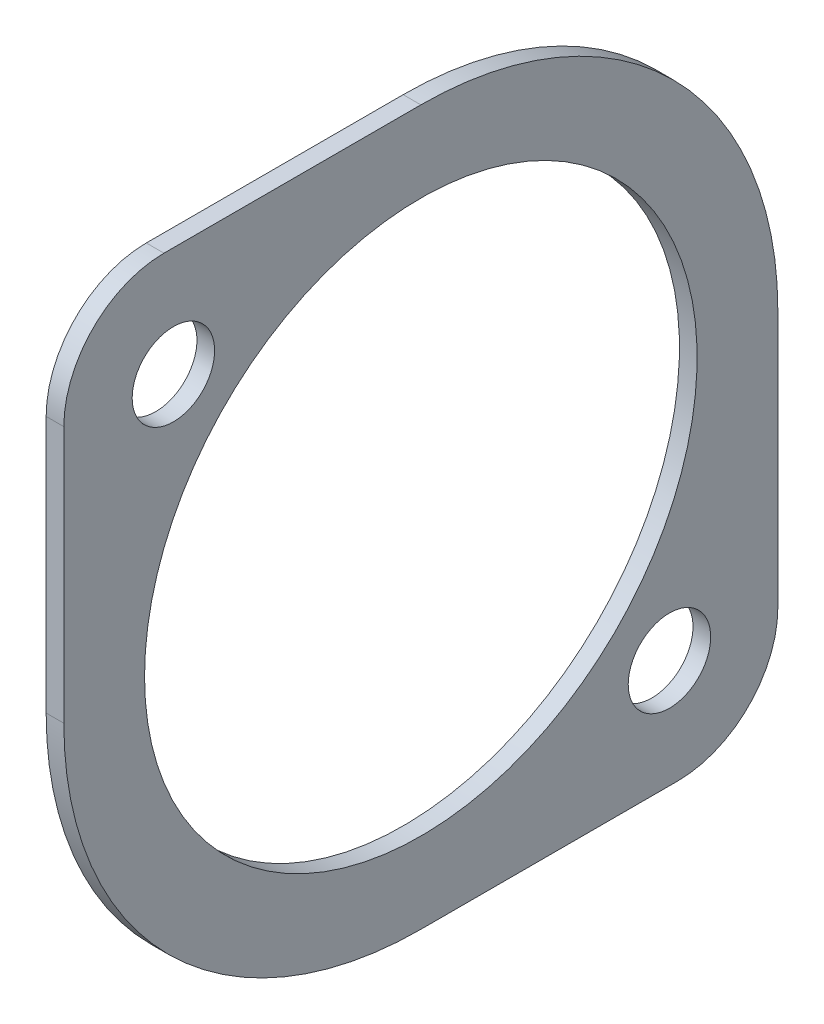
ISO-10303-21;
HEADER;
FILE_DESCRIPTION(('STEP AP214'),'2;1');
FILE_NAME('part.step','',(''),(''),'','','');
FILE_SCHEMA(('AUTOMOTIVE_DESIGN { 1 0 10303 214 1 1 1 1 }'));
ENDSEC;
DATA;
#1=APPLICATION_CONTEXT('core data for automotive mechanical design processes');
#2=APPLICATION_PROTOCOL_DEFINITION('international standard','automotive_design',2000,#1);
#3=PRODUCT_CONTEXT('',#1,'mechanical');
#4=PRODUCT('Part','Part','',(#3));
#5=PRODUCT_RELATED_PRODUCT_CATEGORY('part','',(#4));
#6=PRODUCT_DEFINITION_FORMATION('','',#4);
#7=PRODUCT_DEFINITION_CONTEXT('part definition',#1,'design');
#8=PRODUCT_DEFINITION('design','',#6,#7);
#9=PRODUCT_DEFINITION_SHAPE('','',#8);
#10=(LENGTH_UNIT() NAMED_UNIT(*) SI_UNIT(.MILLI.,.METRE.));
#11=(NAMED_UNIT(*) PLANE_ANGLE_UNIT() SI_UNIT($,.RADIAN.));
#12=(NAMED_UNIT(*) SI_UNIT($,.STERADIAN.) SOLID_ANGLE_UNIT());
#13=UNCERTAINTY_MEASURE_WITH_UNIT(LENGTH_MEASURE(1.E-05),#10,'distance_accuracy_value','');
#14=(GEOMETRIC_REPRESENTATION_CONTEXT(3) GLOBAL_UNCERTAINTY_ASSIGNED_CONTEXT((#13)) GLOBAL_UNIT_ASSIGNED_CONTEXT((#10,
#11,#12)) REPRESENTATION_CONTEXT('',''));
#15=CARTESIAN_POINT('',(0.,0.,0.));
#16=DIRECTION('',(0.,0.,1.));
#17=DIRECTION('',(1.,0.,0.));
#18=AXIS2_PLACEMENT_3D('',#15,#16,#17);
#19=CARTESIAN_POINT('',(1.11633201222204,15.875,-15.875));
#20=DIRECTION('',(1.,0.,0.));
#21=DIRECTION('',(0.,0.,-1.));
#22=AXIS2_PLACEMENT_3D('',#19,#20,#21);
#23=PLANE('',#22);
#24=CARTESIAN_POINT('',(1.11633201222204,21.209,-10.541));
#25=DIRECTION('',(-1.,0.,0.));
#26=DIRECTION('',(0.,0.,1.));
#27=AXIS2_PLACEMENT_3D('',#24,#25,#26);
#28=CIRCLE('',#27,0.889);
#29=CARTESIAN_POINT('',(1.11633201222204,21.209,-9.652));
#30=VERTEX_POINT('',#29);
#31=EDGE_CURVE('E133',#30,#30,#28,.F.);
#32=ORIENTED_EDGE('',*,*,#31,.T.);
#33=EDGE_LOOP('',(#32));
#34=FACE_BOUND('',#33,.T.);
#35=CARTESIAN_POINT('',(1.11633201222204,10.5156,-21.2344));
#36=DIRECTION('',(-1.,0.,0.));
#37=DIRECTION('',(0.,0.,1.));
#38=AXIS2_PLACEMENT_3D('',#35,#36,#37);
#39=CIRCLE('',#38,0.889);
#40=CARTESIAN_POINT('',(1.11633201222204,10.5156,-20.3454));
#41=VERTEX_POINT('',#40);
#42=EDGE_CURVE('E136',#41,#41,#39,.F.);
#43=ORIENTED_EDGE('',*,*,#42,.T.);
#44=EDGE_LOOP('',(#43));
#45=FACE_BOUND('',#44,.T.);
#46=CARTESIAN_POINT('',(1.11633201222204,15.875,-15.875));
#47=DIRECTION('',(-1.,0.,0.));
#48=DIRECTION('',(0.,0.,1.));
#49=AXIS2_PLACEMENT_3D('',#46,#47,#48);
#50=CIRCLE('',#49,5.9563);
#51=CARTESIAN_POINT('',(1.11633201222204,15.875,-9.9187));
#52=VERTEX_POINT('',#51);
#53=EDGE_CURVE('E99',#52,#52,#50,.F.);
#54=ORIENTED_EDGE('',*,*,#53,.T.);
#55=EDGE_LOOP('',(#54));
#56=FACE_BOUND('',#55,.T.);
#57=DIRECTION('',(0.,1.,0.));
#58=VECTOR('',#57,1.);
#59=CARTESIAN_POINT('',(1.11633201222204,18.6436,-8.1788));
#60=LINE('',#59,#58);
#61=CARTESIAN_POINT('',(1.11633201222204,21.4122,-8.1788));
#62=VERTEX_POINT('',#61);
#63=CARTESIAN_POINT('',(1.11633201222204,15.875,-8.1788));
#64=VERTEX_POINT('',#63);
#65=EDGE_CURVE('E105',#62,#64,#60,.F.);
#66=ORIENTED_EDGE('',*,*,#65,.F.);
#67=CARTESIAN_POINT('',(1.11633201222204,21.4122,-10.3378));
#68=DIRECTION('',(-1.,0.,0.));
#69=DIRECTION('',(0.,0.,1.));
#70=AXIS2_PLACEMENT_3D('',#67,#68,#69);
#71=CIRCLE('',#70,2.159);
#72=CARTESIAN_POINT('',(1.11633201222204,23.5712,-10.3378));
#73=VERTEX_POINT('',#72);
#74=EDGE_CURVE('E142',#73,#62,#71,.F.);
#75=ORIENTED_EDGE('',*,*,#74,.F.);
#76=DIRECTION('',(0.,0.,1.));
#77=VECTOR('',#76,1.);
#78=CARTESIAN_POINT('',(1.11633201222204,23.5712,-13.1064));
#79=LINE('',#78,#77);
#80=CARTESIAN_POINT('',(1.11633201222204,23.5712,-15.875));
#81=VERTEX_POINT('',#80);
#82=EDGE_CURVE('E109',#81,#73,#79,.T.);
#83=ORIENTED_EDGE('',*,*,#82,.F.);
#84=CARTESIAN_POINT('',(1.11633201222204,15.875,-15.875));
#85=DIRECTION('',(-1.,0.,0.));
#86=DIRECTION('',(0.,0.,1.));
#87=AXIS2_PLACEMENT_3D('',#84,#85,#86);
#88=CIRCLE('',#87,7.6962);
#89=CARTESIAN_POINT('',(1.11633201222204,15.875,-23.5712));
#90=VERTEX_POINT('',#89);
#91=EDGE_CURVE('E143',#90,#81,#88,.F.);
#92=ORIENTED_EDGE('',*,*,#91,.F.);
#93=DIRECTION('',(0.,1.,0.));
#94=VECTOR('',#93,1.);
#95=CARTESIAN_POINT('',(1.11633201222204,13.1064,-23.5712));
#96=LINE('',#95,#94);
#97=CARTESIAN_POINT('',(1.11633201222204,10.3378,-23.5712));
#98=VERTEX_POINT('',#97);
#99=EDGE_CURVE('E85',#90,#98,#96,.F.);
#100=ORIENTED_EDGE('',*,*,#99,.T.);
#101=CARTESIAN_POINT('',(1.11633201222204,10.3378,-21.4122));
#102=DIRECTION('',(-1.,0.,0.));
#103=DIRECTION('',(0.,0.,1.));
#104=AXIS2_PLACEMENT_3D('',#101,#102,#103);
#105=CIRCLE('',#104,2.159);
#106=CARTESIAN_POINT('',(1.11633201222204,8.1788,-21.4122));
#107=VERTEX_POINT('',#106);
#108=EDGE_CURVE('E19',#107,#98,#105,.F.);
#109=ORIENTED_EDGE('',*,*,#108,.F.);
#110=DIRECTION('',(0.,0.,1.));
#111=VECTOR('',#110,1.);
#112=CARTESIAN_POINT('',(1.11633201222204,8.1788,-18.6436));
#113=LINE('',#112,#111);
#114=CARTESIAN_POINT('',(1.11633201222204,8.1788,-15.875));
#115=VERTEX_POINT('',#114);
#116=EDGE_CURVE('E83',#107,#115,#113,.T.);
#117=ORIENTED_EDGE('',*,*,#116,.T.);
#118=CARTESIAN_POINT('',(1.11633201222204,15.875,-15.875));
#119=DIRECTION('',(-1.,0.,0.));
#120=DIRECTION('',(0.,0.,1.));
#121=AXIS2_PLACEMENT_3D('',#118,#119,#120);
#122=CIRCLE('',#121,7.6962);
#123=EDGE_CURVE('E95',#64,#115,#122,.F.);
#124=ORIENTED_EDGE('',*,*,#123,.F.);
#125=EDGE_LOOP('',(#66,#75,#83,#92,#100,#109,#117,#124));
#126=FACE_BOUND('',#125,.T.);
#127=ADVANCED_FACE('F16',(#34,#45,#56,#126),#23,.F.);
#128=CARTESIAN_POINT('',(1.52345778202475,10.3378,-21.4122));
#129=DIRECTION('',(-1.,0.,0.));
#130=DIRECTION('',(0.,0.,1.));
#131=AXIS2_PLACEMENT_3D('',#128,#129,#130);
#132=CYLINDRICAL_SURFACE('',#131,2.159);
#133=DIRECTION('',(1.,0.,0.));
#134=VECTOR('',#133,1.);
#135=CARTESIAN_POINT('',(1.30683201222204,10.3378,-23.5712));
#136=LINE('',#135,#134);
#137=CARTESIAN_POINT('',(1.49733201222204,10.3378,-23.5712));
#138=VERTEX_POINT('',#137);
#139=EDGE_CURVE('E103',#98,#138,#136,.T.);
#140=ORIENTED_EDGE('',*,*,#139,.T.);
#141=CARTESIAN_POINT('',(1.49733201222204,10.3378,-21.4122));
#142=DIRECTION('',(-1.,0.,0.));
#143=DIRECTION('',(0.,0.,1.));
#144=AXIS2_PLACEMENT_3D('',#141,#142,#143);
#145=CIRCLE('',#144,2.159);
#146=CARTESIAN_POINT('',(1.49733201222204,8.1788,-21.4122));
#147=VERTEX_POINT('',#146);
#148=EDGE_CURVE('E92',#147,#138,#145,.F.);
#149=ORIENTED_EDGE('',*,*,#148,.F.);
#150=DIRECTION('',(1.,0.,0.));
#151=VECTOR('',#150,1.);
#152=CARTESIAN_POINT('',(1.30683201222204,8.1788,-21.4122));
#153=LINE('',#152,#151);
#154=EDGE_CURVE('E89',#147,#107,#153,.F.);
#155=ORIENTED_EDGE('',*,*,#154,.T.);
#156=ORIENTED_EDGE('',*,*,#108,.T.);
#157=EDGE_LOOP('',(#140,#149,#155,#156));
#158=FACE_BOUND('',#157,.T.);
#159=ADVANCED_FACE('F90',(#158),#132,.T.);
#160=CARTESIAN_POINT('',(1.30683201222204,13.1064,-23.5712));
#161=DIRECTION('',(0.,0.,1.));
#162=DIRECTION('',(1.,0.,0.));
#163=AXIS2_PLACEMENT_3D('',#160,#161,#162);
#164=PLANE('',#163);
#165=ORIENTED_EDGE('',*,*,#99,.F.);
#166=DIRECTION('',(-1.,0.,0.));
#167=VECTOR('',#166,1.);
#168=CARTESIAN_POINT('',(1.52345778202475,15.875,-23.5712));
#169=LINE('',#168,#167);
#170=CARTESIAN_POINT('',(1.49733201222204,15.875,-23.5712));
#171=VERTEX_POINT('',#170);
#172=EDGE_CURVE('E144',#171,#90,#169,.T.);
#173=ORIENTED_EDGE('',*,*,#172,.F.);
#174=DIRECTION('',(0.,1.,0.));
#175=VECTOR('',#174,1.);
#176=CARTESIAN_POINT('',(1.49733201222204,15.875,-23.5712));
#177=LINE('',#176,#175);
#178=EDGE_CURVE('E131',#138,#171,#177,.T.);
#179=ORIENTED_EDGE('',*,*,#178,.F.);
#180=ORIENTED_EDGE('',*,*,#139,.F.);
#181=EDGE_LOOP('',(#165,#173,#179,#180));
#182=FACE_BOUND('',#181,.T.);
#183=ADVANCED_FACE('F180',(#182),#164,.F.);
#184=CARTESIAN_POINT('',(1.52345778202475,15.875,-15.875));
#185=DIRECTION('',(-1.,0.,0.));
#186=DIRECTION('',(0.,0.,1.));
#187=AXIS2_PLACEMENT_3D('',#184,#185,#186);
#188=CYLINDRICAL_SURFACE('',#187,7.6962);
#189=DIRECTION('',(1.,0.,0.));
#190=VECTOR('',#189,1.);
#191=CARTESIAN_POINT('',(1.30683201222204,23.5712,-15.875));
#192=LINE('',#191,#190);
#193=CARTESIAN_POINT('',(1.49733201222204,23.5712,-15.875));
#194=VERTEX_POINT('',#193);
#195=EDGE_CURVE('E112',#194,#81,#192,.F.);
#196=ORIENTED_EDGE('',*,*,#195,.F.);
#197=CARTESIAN_POINT('',(1.49733201222204,15.875,-15.875));
#198=DIRECTION('',(-1.,0.,0.));
#199=DIRECTION('',(0.,0.,1.));
#200=AXIS2_PLACEMENT_3D('',#197,#198,#199);
#201=CIRCLE('',#200,7.6962);
#202=EDGE_CURVE('E128',#171,#194,#201,.F.);
#203=ORIENTED_EDGE('',*,*,#202,.F.);
#204=ORIENTED_EDGE('',*,*,#172,.T.);
#205=ORIENTED_EDGE('',*,*,#91,.T.);
#206=EDGE_LOOP('',(#196,#203,#204,#205));
#207=FACE_BOUND('',#206,.T.);
#208=ADVANCED_FACE('F177',(#207),#188,.T.);
#209=CARTESIAN_POINT('',(1.30683201222204,23.5712,-13.1064));
#210=DIRECTION('',(0.,1.,0.));
#211=DIRECTION('',(0.,0.,1.));
#212=AXIS2_PLACEMENT_3D('',#209,#210,#211);
#213=PLANE('',#212);
#214=DIRECTION('',(-1.,0.,0.));
#215=VECTOR('',#214,1.);
#216=CARTESIAN_POINT('',(1.52345778202475,23.5712,-10.3378));
#217=LINE('',#216,#215);
#218=CARTESIAN_POINT('',(1.49733201222204,23.5712,-10.3378));
#219=VERTEX_POINT('',#218);
#220=EDGE_CURVE('E111',#219,#73,#217,.T.);
#221=ORIENTED_EDGE('',*,*,#220,.F.);
#222=DIRECTION('',(0.,0.,-1.));
#223=VECTOR('',#222,1.);
#224=CARTESIAN_POINT('',(1.49733201222204,23.5712,-15.875));
#225=LINE('',#224,#223);
#226=EDGE_CURVE('E127',#194,#219,#225,.F.);
#227=ORIENTED_EDGE('',*,*,#226,.F.);
#228=ORIENTED_EDGE('',*,*,#195,.T.);
#229=ORIENTED_EDGE('',*,*,#82,.T.);
#230=EDGE_LOOP('',(#221,#227,#228,#229));
#231=FACE_BOUND('',#230,.T.);
#232=ADVANCED_FACE('F176',(#231),#213,.T.);
#233=CARTESIAN_POINT('',(1.52345778202475,21.4122,-10.3378));
#234=DIRECTION('',(-1.,0.,0.));
#235=DIRECTION('',(0.,0.,1.));
#236=AXIS2_PLACEMENT_3D('',#233,#234,#235);
#237=CYLINDRICAL_SURFACE('',#236,2.159);
#238=DIRECTION('',(1.,0.,0.));
#239=VECTOR('',#238,1.);
#240=CARTESIAN_POINT('',(1.30683201222204,21.4122,-8.1788));
#241=LINE('',#240,#239);
#242=CARTESIAN_POINT('',(1.49733201222204,21.4122,-8.1788));
#243=VERTEX_POINT('',#242);
#244=EDGE_CURVE('E108',#243,#62,#241,.F.);
#245=ORIENTED_EDGE('',*,*,#244,.F.);
#246=CARTESIAN_POINT('',(1.49733201222204,21.4122,-10.3378));
#247=DIRECTION('',(-1.,0.,0.));
#248=DIRECTION('',(0.,0.,1.));
#249=AXIS2_PLACEMENT_3D('',#246,#247,#248);
#250=CIRCLE('',#249,2.159);
#251=EDGE_CURVE('E124',#219,#243,#250,.F.);
#252=ORIENTED_EDGE('',*,*,#251,.F.);
#253=ORIENTED_EDGE('',*,*,#220,.T.);
#254=ORIENTED_EDGE('',*,*,#74,.T.);
#255=EDGE_LOOP('',(#245,#252,#253,#254));
#256=FACE_BOUND('',#255,.T.);
#257=ADVANCED_FACE('F173',(#256),#237,.T.);
#258=CARTESIAN_POINT('',(1.30683201222204,18.6436,-8.1788));
#259=DIRECTION('',(0.,0.,1.));
#260=DIRECTION('',(1.,0.,0.));
#261=AXIS2_PLACEMENT_3D('',#258,#259,#260);
#262=PLANE('',#261);
#263=DIRECTION('',(-1.,0.,0.));
#264=VECTOR('',#263,1.);
#265=CARTESIAN_POINT('',(1.52345778202475,15.875,-8.1788));
#266=LINE('',#265,#264);
#267=CARTESIAN_POINT('',(1.49733201222204,15.875,-8.1788));
#268=VERTEX_POINT('',#267);
#269=EDGE_CURVE('E107',#268,#64,#266,.T.);
#270=ORIENTED_EDGE('',*,*,#269,.F.);
#271=DIRECTION('',(0.,1.,0.));
#272=VECTOR('',#271,1.);
#273=CARTESIAN_POINT('',(1.49733201222204,15.875,-8.1788));
#274=LINE('',#273,#272);
#275=EDGE_CURVE('E123',#243,#268,#274,.F.);
#276=ORIENTED_EDGE('',*,*,#275,.F.);
#277=ORIENTED_EDGE('',*,*,#244,.T.);
#278=ORIENTED_EDGE('',*,*,#65,.T.);
#279=EDGE_LOOP('',(#270,#276,#277,#278));
#280=FACE_BOUND('',#279,.T.);
#281=ADVANCED_FACE('F169',(#280),#262,.T.);
#282=CARTESIAN_POINT('',(1.52345778202475,15.875,-15.875));
#283=DIRECTION('',(-1.,0.,0.));
#284=DIRECTION('',(0.,0.,1.));
#285=AXIS2_PLACEMENT_3D('',#282,#283,#284);
#286=CYLINDRICAL_SURFACE('',#285,7.6962);
#287=DIRECTION('',(1.,0.,0.));
#288=VECTOR('',#287,1.);
#289=CARTESIAN_POINT('',(1.30683201222204,8.1788,-15.875));
#290=LINE('',#289,#288);
#291=CARTESIAN_POINT('',(1.49733201222204,8.1788,-15.875));
#292=VERTEX_POINT('',#291);
#293=EDGE_CURVE('E34',#115,#292,#290,.T.);
#294=ORIENTED_EDGE('',*,*,#293,.T.);
#295=CARTESIAN_POINT('',(1.49733201222204,15.875,-15.875));
#296=DIRECTION('',(-1.,0.,0.));
#297=DIRECTION('',(0.,0.,1.));
#298=AXIS2_PLACEMENT_3D('',#295,#296,#297);
#299=CIRCLE('',#298,7.6962);
#300=EDGE_CURVE('E120',#268,#292,#299,.F.);
#301=ORIENTED_EDGE('',*,*,#300,.F.);
#302=ORIENTED_EDGE('',*,*,#269,.T.);
#303=ORIENTED_EDGE('',*,*,#123,.T.);
#304=EDGE_LOOP('',(#294,#301,#302,#303));
#305=FACE_BOUND('',#304,.T.);
#306=ADVANCED_FACE('F167',(#305),#286,.T.);
#307=CARTESIAN_POINT('',(1.30683201222204,8.1788,-18.6436));
#308=DIRECTION('',(0.,1.,0.));
#309=DIRECTION('',(0.,0.,1.));
#310=AXIS2_PLACEMENT_3D('',#307,#308,#309);
#311=PLANE('',#310);
#312=ORIENTED_EDGE('',*,*,#116,.F.);
#313=ORIENTED_EDGE('',*,*,#154,.F.);
#314=DIRECTION('',(0.,0.,-1.));
#315=VECTOR('',#314,1.);
#316=CARTESIAN_POINT('',(1.49733201222204,8.1788,-15.875));
#317=LINE('',#316,#315);
#318=EDGE_CURVE('E119',#292,#147,#317,.T.);
#319=ORIENTED_EDGE('',*,*,#318,.F.);
#320=ORIENTED_EDGE('',*,*,#293,.F.);
#321=EDGE_LOOP('',(#312,#313,#319,#320));
#322=FACE_BOUND('',#321,.T.);
#323=ADVANCED_FACE('F97',(#322),#311,.F.);
#324=CARTESIAN_POINT('',(1.52345778202475,15.875,-15.875));
#325=DIRECTION('',(-1.,0.,0.));
#326=DIRECTION('',(0.,0.,1.));
#327=AXIS2_PLACEMENT_3D('',#324,#325,#326);
#328=CYLINDRICAL_SURFACE('',#327,5.9563);
#329=ORIENTED_EDGE('',*,*,#53,.F.);
#330=EDGE_LOOP('',(#329));
#331=FACE_BOUND('',#330,.T.);
#332=CARTESIAN_POINT('',(1.49733201222204,15.875,-15.875));
#333=DIRECTION('',(-1.,0.,0.));
#334=DIRECTION('',(0.,0.,1.));
#335=AXIS2_PLACEMENT_3D('',#332,#333,#334);
#336=CIRCLE('',#335,5.9563);
#337=CARTESIAN_POINT('',(1.49733201222204,15.875,-9.9187));
#338=VERTEX_POINT('',#337);
#339=EDGE_CURVE('E116',#338,#338,#336,.T.);
#340=ORIENTED_EDGE('',*,*,#339,.F.);
#341=EDGE_LOOP('',(#340));
#342=FACE_BOUND('',#341,.T.);
#343=ADVANCED_FACE('F203',(#331,#342),#328,.F.);
#344=CARTESIAN_POINT('',(1.52345778202475,10.5156,-21.2344));
#345=DIRECTION('',(-1.,0.,0.));
#346=DIRECTION('',(0.,0.,1.));
#347=AXIS2_PLACEMENT_3D('',#344,#345,#346);
#348=CYLINDRICAL_SURFACE('',#347,0.889);
#349=ORIENTED_EDGE('',*,*,#42,.F.);
#350=EDGE_LOOP('',(#349));
#351=FACE_BOUND('',#350,.T.);
#352=CARTESIAN_POINT('',(1.49733201222204,10.5156,-21.2344));
#353=DIRECTION('',(-1.,0.,0.));
#354=DIRECTION('',(0.,0.,1.));
#355=AXIS2_PLACEMENT_3D('',#352,#353,#354);
#356=CIRCLE('',#355,0.889);
#357=CARTESIAN_POINT('',(1.49733201222204,10.5156,-20.3454));
#358=VERTEX_POINT('',#357);
#359=EDGE_CURVE('E25',#358,#358,#356,.T.);
#360=ORIENTED_EDGE('',*,*,#359,.F.);
#361=EDGE_LOOP('',(#360));
#362=FACE_BOUND('',#361,.T.);
#363=ADVANCED_FACE('F196',(#351,#362),#348,.F.);
#364=CARTESIAN_POINT('',(1.52345778202475,21.209,-10.541));
#365=DIRECTION('',(-1.,0.,0.));
#366=DIRECTION('',(0.,0.,1.));
#367=AXIS2_PLACEMENT_3D('',#364,#365,#366);
#368=CYLINDRICAL_SURFACE('',#367,0.889);
#369=ORIENTED_EDGE('',*,*,#31,.F.);
#370=EDGE_LOOP('',(#369));
#371=FACE_BOUND('',#370,.T.);
#372=CARTESIAN_POINT('',(1.49733201222204,21.209,-10.541));
#373=DIRECTION('',(-1.,0.,0.));
#374=DIRECTION('',(0.,0.,1.));
#375=AXIS2_PLACEMENT_3D('',#372,#373,#374);
#376=CIRCLE('',#375,0.889);
#377=CARTESIAN_POINT('',(1.49733201222204,21.209,-9.652));
#378=VERTEX_POINT('',#377);
#379=EDGE_CURVE('E11',#378,#378,#376,.T.);
#380=ORIENTED_EDGE('',*,*,#379,.F.);
#381=EDGE_LOOP('',(#380));
#382=FACE_BOUND('',#381,.T.);
#383=ADVANCED_FACE('F190',(#371,#382),#368,.F.);
#384=CARTESIAN_POINT('',(1.49733201222204,15.875,-15.875));
#385=DIRECTION('',(1.,0.,0.));
#386=DIRECTION('',(0.,0.,-1.));
#387=AXIS2_PLACEMENT_3D('',#384,#385,#386);
#388=PLANE('',#387);
#389=ORIENTED_EDGE('',*,*,#379,.T.);
#390=EDGE_LOOP('',(#389));
#391=FACE_BOUND('',#390,.T.);
#392=ORIENTED_EDGE('',*,*,#359,.T.);
#393=EDGE_LOOP('',(#392));
#394=FACE_BOUND('',#393,.T.);
#395=ORIENTED_EDGE('',*,*,#339,.T.);
#396=EDGE_LOOP('',(#395));
#397=FACE_BOUND('',#396,.T.);
#398=ORIENTED_EDGE('',*,*,#300,.T.);
#399=ORIENTED_EDGE('',*,*,#318,.T.);
#400=ORIENTED_EDGE('',*,*,#148,.T.);
#401=ORIENTED_EDGE('',*,*,#178,.T.);
#402=ORIENTED_EDGE('',*,*,#202,.T.);
#403=ORIENTED_EDGE('',*,*,#226,.T.);
#404=ORIENTED_EDGE('',*,*,#251,.T.);
#405=ORIENTED_EDGE('',*,*,#275,.T.);
#406=EDGE_LOOP('',(#398,#399,#400,#401,#402,#403,#404,#405));
#407=FACE_BOUND('',#406,.T.);
#408=ADVANCED_FACE('F165',(#391,#394,#397,#407),#388,.T.);
#409=CLOSED_SHELL('',(#127,#159,#183,#208,#232,#257,#281,#306,#323,#343,#363,#383,#408));
#410=MANIFOLD_SOLID_BREP('B1',#409);
#411=ADVANCED_BREP_SHAPE_REPRESENTATION('',(#18,#410),#14);
#412=SHAPE_DEFINITION_REPRESENTATION(#9,#411);
ENDSEC;
END-ISO-10303-21;
